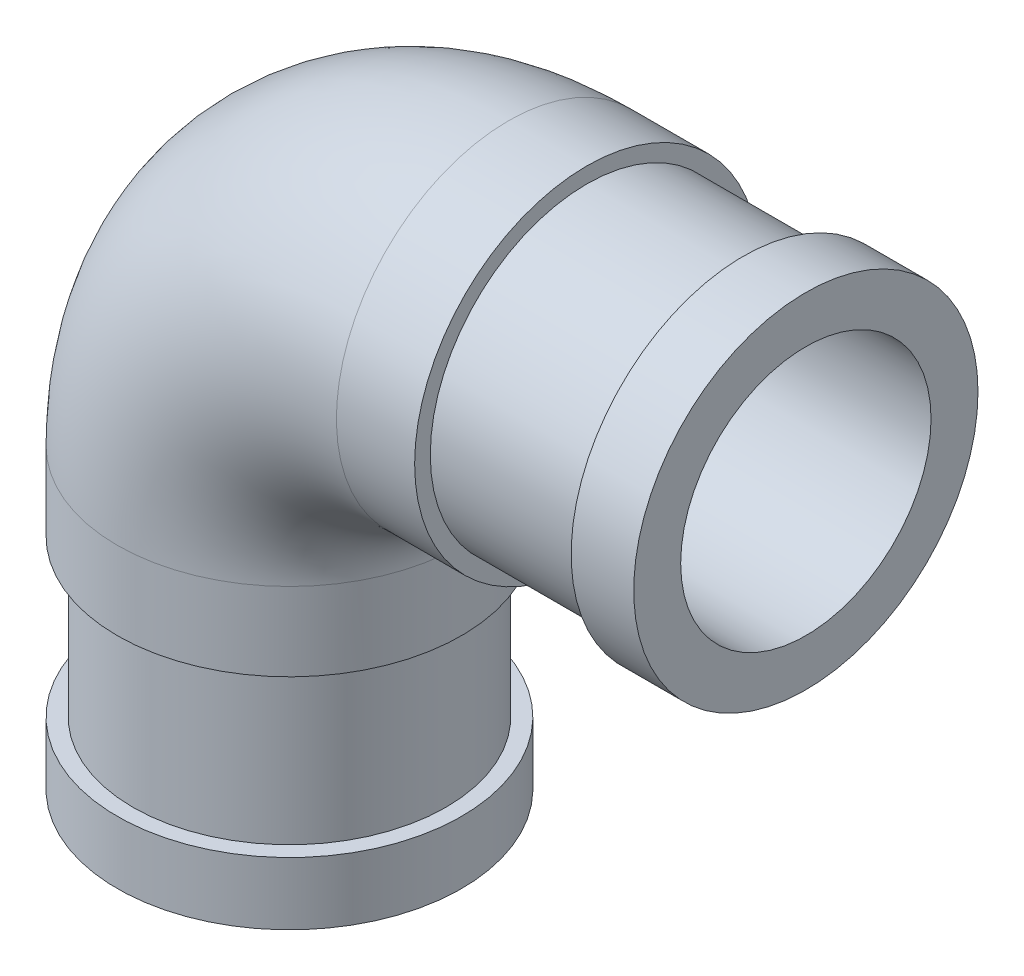
ISO-10303-21;
HEADER;
FILE_DESCRIPTION(('STEP AP214'),'2;1');
FILE_NAME('part.step','',(''),(''),'','','');
FILE_SCHEMA(('AUTOMOTIVE_DESIGN { 1 0 10303 214 1 1 1 1 }'));
ENDSEC;
DATA;
#1=APPLICATION_CONTEXT('core data for automotive mechanical design processes');
#2=APPLICATION_PROTOCOL_DEFINITION('international standard','automotive_design',2000,#1);
#3=PRODUCT_CONTEXT('',#1,'mechanical');
#4=PRODUCT('Part','Part','',(#3));
#5=PRODUCT_RELATED_PRODUCT_CATEGORY('part','',(#4));
#6=PRODUCT_DEFINITION_FORMATION('','',#4);
#7=PRODUCT_DEFINITION_CONTEXT('part definition',#1,'design');
#8=PRODUCT_DEFINITION('design','',#6,#7);
#9=PRODUCT_DEFINITION_SHAPE('','',#8);
#10=(LENGTH_UNIT() NAMED_UNIT(*) SI_UNIT(.MILLI.,.METRE.));
#11=(NAMED_UNIT(*) PLANE_ANGLE_UNIT() SI_UNIT($,.RADIAN.));
#12=(NAMED_UNIT(*) SI_UNIT($,.STERADIAN.) SOLID_ANGLE_UNIT());
#13=UNCERTAINTY_MEASURE_WITH_UNIT(LENGTH_MEASURE(1.E-05),#10,'distance_accuracy_value','');
#14=(GEOMETRIC_REPRESENTATION_CONTEXT(3) GLOBAL_UNCERTAINTY_ASSIGNED_CONTEXT((#13)) GLOBAL_UNIT_ASSIGNED_CONTEXT((#10,
#11,#12)) REPRESENTATION_CONTEXT('',''));
#15=CARTESIAN_POINT('',(0.,0.,0.));
#16=DIRECTION('',(0.,0.,1.));
#17=DIRECTION('',(1.,0.,0.));
#18=AXIS2_PLACEMENT_3D('',#15,#16,#17);
#19=CARTESIAN_POINT('',(-14.,-5.,0.));
#20=DIRECTION('',(0.,-1.,0.));
#21=DIRECTION('',(0.,0.,1.));
#22=AXIS2_PLACEMENT_3D('',#19,#20,#21);
#23=PLANE('',#22);
#24=CARTESIAN_POINT('',(-14.,-5.,0.));
#25=DIRECTION('',(0.,-1.,0.));
#26=DIRECTION('',(0.,0.,-1.));
#27=AXIS2_PLACEMENT_3D('',#24,#25,#26);
#28=CIRCLE('',#27,10.);
#29=CARTESIAN_POINT('',(-14.,-5.,-10.));
#30=VERTEX_POINT('',#29);
#31=EDGE_CURVE('E53',#30,#30,#28,.T.);
#32=ORIENTED_EDGE('',*,*,#31,.F.);
#33=EDGE_LOOP('',(#32));
#34=FACE_BOUND('',#33,.T.);
#35=CARTESIAN_POINT('',(-14.,-5.,0.));
#36=DIRECTION('',(0.,-1.,0.));
#37=DIRECTION('',(0.,0.,1.));
#38=AXIS2_PLACEMENT_3D('',#35,#36,#37);
#39=CIRCLE('',#38,11.);
#40=CARTESIAN_POINT('',(-14.,-5.,11.));
#41=VERTEX_POINT('',#40);
#42=EDGE_CURVE('E81',#41,#41,#39,.T.);
#43=ORIENTED_EDGE('',*,*,#42,.T.);
#44=EDGE_LOOP('',(#43));
#45=FACE_BOUND('',#44,.T.);
#46=ADVANCED_FACE('F46',(#34,#45),#23,.T.);
#47=CARTESIAN_POINT('',(5.,14.,0.));
#48=DIRECTION('',(-1.,0.,0.));
#49=DIRECTION('',(0.,0.,1.));
#50=AXIS2_PLACEMENT_3D('',#47,#48,#49);
#51=PLANE('',#50);
#52=CARTESIAN_POINT('',(5.,14.,0.));
#53=DIRECTION('',(1.,0.,0.));
#54=DIRECTION('',(0.,0.,-1.));
#55=AXIS2_PLACEMENT_3D('',#52,#53,#54);
#56=CIRCLE('',#55,10.);
#57=CARTESIAN_POINT('',(5.,14.,-10.));
#58=VERTEX_POINT('',#57);
#59=EDGE_CURVE('E11',#58,#58,#56,.T.);
#60=ORIENTED_EDGE('',*,*,#59,.F.);
#61=EDGE_LOOP('',(#60));
#62=FACE_BOUND('',#61,.T.);
#63=CARTESIAN_POINT('',(5.,14.,0.));
#64=DIRECTION('',(-1.,0.,0.));
#65=DIRECTION('',(0.,0.,1.));
#66=AXIS2_PLACEMENT_3D('',#63,#64,#65);
#67=CIRCLE('',#66,11.);
#68=CARTESIAN_POINT('',(5.,14.,11.));
#69=VERTEX_POINT('',#68);
#70=EDGE_CURVE('E49',#69,#69,#67,.T.);
#71=ORIENTED_EDGE('',*,*,#70,.F.);
#72=EDGE_LOOP('',(#71));
#73=FACE_BOUND('',#72,.T.);
#74=ADVANCED_FACE('F96',(#62,#73),#51,.F.);
#75=CARTESIAN_POINT('',(-14.,-5.,0.));
#76=DIRECTION('',(0.,1.,0.));
#77=DIRECTION('',(0.,0.,1.));
#78=AXIS2_PLACEMENT_3D('',#75,#76,#77);
#79=CYLINDRICAL_SURFACE('',#78,11.);
#80=CARTESIAN_POINT('',(-14.,0.,0.));
#81=DIRECTION('',(0.,-1.,0.));
#82=DIRECTION('',(0.,0.,1.));
#83=AXIS2_PLACEMENT_3D('',#80,#81,#82);
#84=CIRCLE('',#83,11.);
#85=CARTESIAN_POINT('',(-25.,0.,0.));
#86=VERTEX_POINT('',#85);
#87=EDGE_CURVE('E84',#86,#86,#84,.T.);
#88=ORIENTED_EDGE('',*,*,#87,.T.);
#89=EDGE_LOOP('',(#88));
#90=FACE_BOUND('',#89,.T.);
#91=ORIENTED_EDGE('',*,*,#42,.F.);
#92=EDGE_LOOP('',(#91));
#93=FACE_BOUND('',#92,.T.);
#94=ADVANCED_FACE('F98',(#90,#93),#79,.T.);
#95=CARTESIAN_POINT('',(0.,0.,0.));
#96=DIRECTION('',(0.,0.,-1.));
#97=DIRECTION('',(-1.,0.,0.));
#98=AXIS2_PLACEMENT_3D('',#95,#96,#97);
#99=TOROIDAL_SURFACE('',#98,14.,11.);
#100=CARTESIAN_POINT('',(0.,14.,0.));
#101=DIRECTION('',(-1.,0.,0.));
#102=DIRECTION('',(0.,0.,1.));
#103=AXIS2_PLACEMENT_3D('',#100,#101,#102);
#104=CIRCLE('',#103,11.);
#105=CARTESIAN_POINT('',(0.,25.,0.));
#106=VERTEX_POINT('',#105);
#107=EDGE_CURVE('E86',#106,#106,#104,.T.);
#108=CARTESIAN_POINT('',(0.,0.,0.));
#109=DIRECTION('',(0.,0.,-1.));
#110=DIRECTION('',(-1.,0.,0.));
#111=AXIS2_PLACEMENT_3D('',#108,#109,#110);
#112=CIRCLE('',#111,25.);
#113=EDGE_CURVE('',#86,#106,#112,.T.);
#114=ORIENTED_EDGE('',*,*,#87,.F.);
#115=ORIENTED_EDGE('',*,*,#107,.T.);
#116=ORIENTED_EDGE('',*,*,#113,.T.);
#117=ORIENTED_EDGE('',*,*,#113,.F.);
#118=EDGE_LOOP('',(#114,#116,#115,#117));
#119=FACE_BOUND('',#118,.T.);
#120=ADVANCED_FACE('F104',(#119),#99,.T.);
#121=CARTESIAN_POINT('',(0.,14.,0.));
#122=DIRECTION('',(1.,0.,0.));
#123=DIRECTION('',(0.,0.,-1.));
#124=AXIS2_PLACEMENT_3D('',#121,#122,#123);
#125=CYLINDRICAL_SURFACE('',#124,11.);
#126=ORIENTED_EDGE('',*,*,#70,.T.);
#127=EDGE_LOOP('',(#126));
#128=FACE_BOUND('',#127,.T.);
#129=ORIENTED_EDGE('',*,*,#107,.F.);
#130=EDGE_LOOP('',(#129));
#131=FACE_BOUND('',#130,.T.);
#132=ADVANCED_FACE('F93',(#128,#131),#125,.T.);
#133=CARTESIAN_POINT('',(-14.,-5.,0.));
#134=DIRECTION('',(0.,1.,0.));
#135=DIRECTION('',(0.,0.,1.));
#136=AXIS2_PLACEMENT_3D('',#133,#134,#135);
#137=CYLINDRICAL_SURFACE('',#136,8.);
#138=CARTESIAN_POINT('',(-14.,0.,0.));
#139=DIRECTION('',(0.,1.,0.));
#140=DIRECTION('',(0.,0.,1.));
#141=AXIS2_PLACEMENT_3D('',#138,#139,#140);
#142=CIRCLE('',#141,8.);
#143=CARTESIAN_POINT('',(-22.,0.,0.));
#144=VERTEX_POINT('',#143);
#145=EDGE_CURVE('E74',#144,#144,#142,.F.);
#146=ORIENTED_EDGE('',*,*,#145,.F.);
#147=EDGE_LOOP('',(#146));
#148=FACE_BOUND('',#147,.T.);
#149=CARTESIAN_POINT('',(-14.,-19.,0.));
#150=DIRECTION('',(0.,-1.,0.));
#151=DIRECTION('',(0.,0.,-1.));
#152=AXIS2_PLACEMENT_3D('',#149,#150,#151);
#153=CIRCLE('',#152,8.);
#154=CARTESIAN_POINT('',(-14.,-19.,-8.));
#155=VERTEX_POINT('',#154);
#156=EDGE_CURVE('E63',#155,#155,#153,.T.);
#157=ORIENTED_EDGE('',*,*,#156,.T.);
#158=EDGE_LOOP('',(#157));
#159=FACE_BOUND('',#158,.T.);
#160=ADVANCED_FACE('F111',(#148,#159),#137,.F.);
#161=CARTESIAN_POINT('',(0.,0.,0.));
#162=DIRECTION('',(0.,0.,-1.));
#163=DIRECTION('',(-1.,0.,0.));
#164=AXIS2_PLACEMENT_3D('',#161,#162,#163);
#165=TOROIDAL_SURFACE('',#164,14.,8.);
#166=CARTESIAN_POINT('',(0.,14.,0.));
#167=DIRECTION('',(-1.,0.,0.));
#168=DIRECTION('',(0.,-1.,0.));
#169=AXIS2_PLACEMENT_3D('',#166,#167,#168);
#170=CIRCLE('',#169,8.);
#171=CARTESIAN_POINT('',(0.,22.,0.));
#172=VERTEX_POINT('',#171);
#173=EDGE_CURVE('E78',#172,#172,#170,.T.);
#174=CARTESIAN_POINT('',(0.,0.,0.));
#175=DIRECTION('',(0.,0.,-1.));
#176=DIRECTION('',(-1.,0.,0.));
#177=AXIS2_PLACEMENT_3D('',#174,#175,#176);
#178=CIRCLE('',#177,22.);
#179=EDGE_CURVE('',#144,#172,#178,.T.);
#180=ORIENTED_EDGE('',*,*,#145,.T.);
#181=ORIENTED_EDGE('',*,*,#173,.F.);
#182=ORIENTED_EDGE('',*,*,#179,.T.);
#183=ORIENTED_EDGE('',*,*,#179,.F.);
#184=EDGE_LOOP('',(#180,#182,#181,#183));
#185=FACE_BOUND('',#184,.T.);
#186=ADVANCED_FACE('F116',(#185),#165,.F.);
#187=CARTESIAN_POINT('',(0.,14.,0.));
#188=DIRECTION('',(1.,0.,0.));
#189=DIRECTION('',(0.,0.,-1.));
#190=AXIS2_PLACEMENT_3D('',#187,#188,#189);
#191=CYLINDRICAL_SURFACE('',#190,8.);
#192=ORIENTED_EDGE('',*,*,#173,.T.);
#193=EDGE_LOOP('',(#192));
#194=FACE_BOUND('',#193,.T.);
#195=CARTESIAN_POINT('',(19.,14.,0.));
#196=DIRECTION('',(1.,0.,0.));
#197=DIRECTION('',(0.,0.,-1.));
#198=AXIS2_PLACEMENT_3D('',#195,#196,#197);
#199=CIRCLE('',#198,8.);
#200=CARTESIAN_POINT('',(19.,14.,-8.));
#201=VERTEX_POINT('',#200);
#202=EDGE_CURVE('E166',#201,#201,#199,.T.);
#203=ORIENTED_EDGE('',*,*,#202,.T.);
#204=EDGE_LOOP('',(#203));
#205=FACE_BOUND('',#204,.T.);
#206=ADVANCED_FACE('F108',(#194,#205),#191,.F.);
#207=CARTESIAN_POINT('',(-14.,-15.,0.));
#208=DIRECTION('',(0.,1.,0.));
#209=DIRECTION('',(0.,0.,1.));
#210=AXIS2_PLACEMENT_3D('',#207,#208,#209);
#211=CYLINDRICAL_SURFACE('',#210,10.);
#212=CARTESIAN_POINT('',(-14.,-15.,0.));
#213=DIRECTION('',(0.,-1.,0.));
#214=DIRECTION('',(0.,0.,-1.));
#215=AXIS2_PLACEMENT_3D('',#212,#213,#214);
#216=CIRCLE('',#215,10.);
#217=CARTESIAN_POINT('',(-14.,-15.,-10.));
#218=VERTEX_POINT('',#217);
#219=EDGE_CURVE('E70',#218,#218,#216,.T.);
#220=ORIENTED_EDGE('',*,*,#219,.F.);
#221=EDGE_LOOP('',(#220));
#222=FACE_BOUND('',#221,.T.);
#223=ORIENTED_EDGE('',*,*,#31,.T.);
#224=EDGE_LOOP('',(#223));
#225=FACE_BOUND('',#224,.T.);
#226=ADVANCED_FACE('F119',(#222,#225),#211,.T.);
#227=CARTESIAN_POINT('',(-14.,-19.,0.));
#228=DIRECTION('',(0.,-1.,0.));
#229=DIRECTION('',(0.,0.,-1.));
#230=AXIS2_PLACEMENT_3D('',#227,#228,#229);
#231=PLANE('',#230);
#232=CARTESIAN_POINT('',(-14.,-19.,0.));
#233=DIRECTION('',(0.,-1.,0.));
#234=DIRECTION('',(0.,0.,-1.));
#235=AXIS2_PLACEMENT_3D('',#232,#233,#234);
#236=CIRCLE('',#235,11.);
#237=CARTESIAN_POINT('',(-14.,-19.,-11.));
#238=VERTEX_POINT('',#237);
#239=EDGE_CURVE('E67',#238,#238,#236,.T.);
#240=ORIENTED_EDGE('',*,*,#239,.T.);
#241=EDGE_LOOP('',(#240));
#242=FACE_BOUND('',#241,.T.);
#243=ORIENTED_EDGE('',*,*,#156,.F.);
#244=EDGE_LOOP('',(#243));
#245=FACE_BOUND('',#244,.T.);
#246=ADVANCED_FACE('F130',(#242,#245),#231,.T.);
#247=CARTESIAN_POINT('',(-14.,-15.,0.));
#248=DIRECTION('',(0.,-1.,0.));
#249=DIRECTION('',(0.,0.,-1.));
#250=AXIS2_PLACEMENT_3D('',#247,#248,#249);
#251=PLANE('',#250);
#252=ORIENTED_EDGE('',*,*,#219,.T.);
#253=EDGE_LOOP('',(#252));
#254=FACE_BOUND('',#253,.T.);
#255=CARTESIAN_POINT('',(-14.,-15.,0.));
#256=DIRECTION('',(0.,-1.,0.));
#257=DIRECTION('',(0.,0.,-1.));
#258=AXIS2_PLACEMENT_3D('',#255,#256,#257);
#259=CIRCLE('',#258,11.);
#260=CARTESIAN_POINT('',(-14.,-15.,-11.));
#261=VERTEX_POINT('',#260);
#262=EDGE_CURVE('E66',#261,#261,#259,.T.);
#263=ORIENTED_EDGE('',*,*,#262,.F.);
#264=EDGE_LOOP('',(#263));
#265=FACE_BOUND('',#264,.T.);
#266=ADVANCED_FACE('F136',(#254,#265),#251,.F.);
#267=CARTESIAN_POINT('',(-14.,-19.,0.));
#268=DIRECTION('',(0.,1.,0.));
#269=DIRECTION('',(0.,0.,1.));
#270=AXIS2_PLACEMENT_3D('',#267,#268,#269);
#271=CYLINDRICAL_SURFACE('',#270,11.);
#272=ORIENTED_EDGE('',*,*,#239,.F.);
#273=EDGE_LOOP('',(#272));
#274=FACE_BOUND('',#273,.T.);
#275=ORIENTED_EDGE('',*,*,#262,.T.);
#276=EDGE_LOOP('',(#275));
#277=FACE_BOUND('',#276,.T.);
#278=ADVANCED_FACE('F132',(#274,#277),#271,.T.);
#279=CARTESIAN_POINT('',(15.,14.,0.));
#280=DIRECTION('',(-1.,0.,0.));
#281=DIRECTION('',(0.,0.,1.));
#282=AXIS2_PLACEMENT_3D('',#279,#280,#281);
#283=CYLINDRICAL_SURFACE('',#282,10.);
#284=CARTESIAN_POINT('',(15.,14.,0.));
#285=DIRECTION('',(1.,0.,0.));
#286=DIRECTION('',(0.,0.,-1.));
#287=AXIS2_PLACEMENT_3D('',#284,#285,#286);
#288=CIRCLE('',#287,10.);
#289=CARTESIAN_POINT('',(15.,14.,-10.));
#290=VERTEX_POINT('',#289);
#291=EDGE_CURVE('E61',#290,#290,#288,.T.);
#292=ORIENTED_EDGE('',*,*,#291,.F.);
#293=EDGE_LOOP('',(#292));
#294=FACE_BOUND('',#293,.T.);
#295=ORIENTED_EDGE('',*,*,#59,.T.);
#296=EDGE_LOOP('',(#295));
#297=FACE_BOUND('',#296,.T.);
#298=ADVANCED_FACE('F135',(#294,#297),#283,.T.);
#299=CARTESIAN_POINT('',(19.,14.,0.));
#300=DIRECTION('',(1.,0.,0.));
#301=DIRECTION('',(0.,0.,-1.));
#302=AXIS2_PLACEMENT_3D('',#299,#300,#301);
#303=PLANE('',#302);
#304=CARTESIAN_POINT('',(19.,14.,0.));
#305=DIRECTION('',(1.,0.,0.));
#306=DIRECTION('',(0.,0.,-1.));
#307=AXIS2_PLACEMENT_3D('',#304,#305,#306);
#308=CIRCLE('',#307,11.);
#309=CARTESIAN_POINT('',(19.,14.,-11.));
#310=VERTEX_POINT('',#309);
#311=EDGE_CURVE('E163',#310,#310,#308,.T.);
#312=ORIENTED_EDGE('',*,*,#311,.T.);
#313=EDGE_LOOP('',(#312));
#314=FACE_BOUND('',#313,.T.);
#315=ORIENTED_EDGE('',*,*,#202,.F.);
#316=EDGE_LOOP('',(#315));
#317=FACE_BOUND('',#316,.T.);
#318=ADVANCED_FACE('F146',(#314,#317),#303,.T.);
#319=CARTESIAN_POINT('',(15.,14.,0.));
#320=DIRECTION('',(1.,0.,0.));
#321=DIRECTION('',(0.,0.,-1.));
#322=AXIS2_PLACEMENT_3D('',#319,#320,#321);
#323=PLANE('',#322);
#324=ORIENTED_EDGE('',*,*,#291,.T.);
#325=EDGE_LOOP('',(#324));
#326=FACE_BOUND('',#325,.T.);
#327=CARTESIAN_POINT('',(15.,14.,0.));
#328=DIRECTION('',(1.,0.,0.));
#329=DIRECTION('',(0.,0.,-1.));
#330=AXIS2_PLACEMENT_3D('',#327,#328,#329);
#331=CIRCLE('',#330,11.);
#332=CARTESIAN_POINT('',(15.,14.,-11.));
#333=VERTEX_POINT('',#332);
#334=EDGE_CURVE('E168',#333,#333,#331,.T.);
#335=ORIENTED_EDGE('',*,*,#334,.F.);
#336=EDGE_LOOP('',(#335));
#337=FACE_BOUND('',#336,.T.);
#338=ADVANCED_FACE('F151',(#326,#337),#323,.F.);
#339=CARTESIAN_POINT('',(19.,14.,0.));
#340=DIRECTION('',(-1.,0.,0.));
#341=DIRECTION('',(0.,0.,1.));
#342=AXIS2_PLACEMENT_3D('',#339,#340,#341);
#343=CYLINDRICAL_SURFACE('',#342,11.);
#344=ORIENTED_EDGE('',*,*,#311,.F.);
#345=EDGE_LOOP('',(#344));
#346=FACE_BOUND('',#345,.T.);
#347=ORIENTED_EDGE('',*,*,#334,.T.);
#348=EDGE_LOOP('',(#347));
#349=FACE_BOUND('',#348,.T.);
#350=ADVANCED_FACE('F148',(#346,#349),#343,.T.);
#351=CLOSED_SHELL('',(#46,#74,#94,#120,#132,#160,#186,#206,#226,#246,#266,#278,#298,#318,#338,#350));
#352=MANIFOLD_SOLID_BREP('B2',#351);
#353=ADVANCED_BREP_SHAPE_REPRESENTATION('',(#18,#352),#14);
#354=SHAPE_DEFINITION_REPRESENTATION(#9,#353);
ENDSEC;
END-ISO-10303-21;
